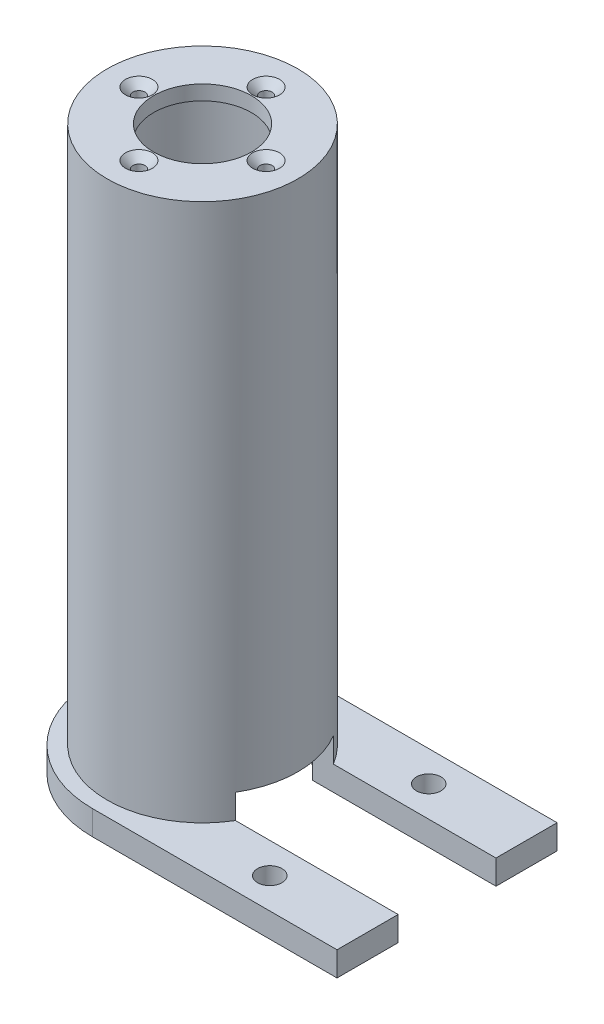
ISO-10303-21;
HEADER;
FILE_DESCRIPTION(('STEP AP214'),'2;1');
FILE_NAME('part.step','',(''),(''),'','','');
FILE_SCHEMA(('AUTOMOTIVE_DESIGN { 1 0 10303 214 1 1 1 1 }'));
ENDSEC;
DATA;
#1=APPLICATION_CONTEXT('core data for automotive mechanical design processes');
#2=APPLICATION_PROTOCOL_DEFINITION('international standard','automotive_design',2000,#1);
#3=PRODUCT_CONTEXT('',#1,'mechanical');
#4=PRODUCT('Part','Part','',(#3));
#5=PRODUCT_RELATED_PRODUCT_CATEGORY('part','',(#4));
#6=PRODUCT_DEFINITION_FORMATION('','',#4);
#7=PRODUCT_DEFINITION_CONTEXT('part definition',#1,'design');
#8=PRODUCT_DEFINITION('design','',#6,#7);
#9=PRODUCT_DEFINITION_SHAPE('','',#8);
#10=(LENGTH_UNIT() NAMED_UNIT(*) SI_UNIT(.MILLI.,.METRE.));
#11=(NAMED_UNIT(*) PLANE_ANGLE_UNIT() SI_UNIT($,.RADIAN.));
#12=(NAMED_UNIT(*) SI_UNIT($,.STERADIAN.) SOLID_ANGLE_UNIT());
#13=UNCERTAINTY_MEASURE_WITH_UNIT(LENGTH_MEASURE(1.E-05),#10,'distance_accuracy_value','');
#14=(GEOMETRIC_REPRESENTATION_CONTEXT(3) GLOBAL_UNCERTAINTY_ASSIGNED_CONTEXT((#13)) GLOBAL_UNIT_ASSIGNED_CONTEXT((#10,
#11,#12)) REPRESENTATION_CONTEXT('',''));
#15=CARTESIAN_POINT('',(0.,0.,0.));
#16=DIRECTION('',(0.,0.,1.));
#17=DIRECTION('',(1.,0.,0.));
#18=AXIS2_PLACEMENT_3D('',#15,#16,#17);
#19=CARTESIAN_POINT('',(0.,-115.,0.));
#20=DIRECTION('',(0.,1.,0.));
#21=DIRECTION('',(0.,0.,1.));
#22=AXIS2_PLACEMENT_3D('',#19,#20,#21);
#23=CYLINDRICAL_SURFACE('',#22,19.5);
#24=CARTESIAN_POINT('',(0.,0.,0.));
#25=DIRECTION('',(0.,1.,0.));
#26=DIRECTION('',(0.,0.,1.));
#27=AXIS2_PLACEMENT_3D('',#24,#25,#26);
#28=CIRCLE('',#27,19.5);
#29=CARTESIAN_POINT('',(0.,0.,19.5));
#30=VERTEX_POINT('',#29);
#31=EDGE_CURVE('E161',#30,#30,#28,.T.);
#32=ORIENTED_EDGE('',*,*,#31,.F.);
#33=EDGE_LOOP('',(#32));
#34=FACE_BOUND('',#33,.T.);
#35=CARTESIAN_POINT('',(0.,-105.,0.));
#36=DIRECTION('',(0.,1.,0.));
#37=DIRECTION('',(0.,0.,1.));
#38=AXIS2_PLACEMENT_3D('',#35,#36,#37);
#39=CIRCLE('',#38,19.5);
#40=CARTESIAN_POINT('',(16.7406690427832,-105.,-10.));
#41=VERTEX_POINT('',#40);
#42=CARTESIAN_POINT('',(16.7406690427832,-105.,10.));
#43=VERTEX_POINT('',#42);
#44=EDGE_CURVE('E217',#41,#43,#39,.F.);
#45=ORIENTED_EDGE('',*,*,#44,.F.);
#46=DIRECTION('',(0.,1.,0.));
#47=VECTOR('',#46,1.);
#48=CARTESIAN_POINT('',(16.7406690427832,-115.,-10.));
#49=LINE('',#48,#47);
#50=CARTESIAN_POINT('',(16.7406690427832,-110.,-10.));
#51=VERTEX_POINT('',#50);
#52=EDGE_CURVE('E230',#41,#51,#49,.F.);
#53=ORIENTED_EDGE('',*,*,#52,.T.);
#54=CARTESIAN_POINT('',(0.,-110.,0.));
#55=DIRECTION('',(0.,1.,0.));
#56=DIRECTION('',(0.,0.,1.));
#57=AXIS2_PLACEMENT_3D('',#54,#55,#56);
#58=CIRCLE('',#57,19.5);
#59=CARTESIAN_POINT('',(16.7406690427832,-110.,10.));
#60=VERTEX_POINT('',#59);
#61=EDGE_CURVE('E164',#60,#51,#58,.F.);
#62=ORIENTED_EDGE('',*,*,#61,.F.);
#63=DIRECTION('',(0.,1.,0.));
#64=VECTOR('',#63,1.);
#65=CARTESIAN_POINT('',(16.7406690427832,-115.,10.));
#66=LINE('',#65,#64);
#67=EDGE_CURVE('E225',#60,#43,#66,.T.);
#68=ORIENTED_EDGE('',*,*,#67,.T.);
#69=EDGE_LOOP('',(#45,#53,#62,#68));
#70=FACE_BOUND('',#69,.T.);
#71=ADVANCED_FACE('F36',(#34,#70),#23,.T.);
#72=CARTESIAN_POINT('',(50.,-110.,0.));
#73=DIRECTION('',(-1.,0.,0.));
#74=DIRECTION('',(0.,0.,1.));
#75=AXIS2_PLACEMENT_3D('',#72,#73,#74);
#76=PLANE('',#75);
#77=DIRECTION('',(0.,-1.,0.));
#78=VECTOR('',#77,1.);
#79=CARTESIAN_POINT('',(50.,-46.1483519286549,-10.));
#80=LINE('',#79,#78);
#81=CARTESIAN_POINT('',(50.,-110.,-10.));
#82=VERTEX_POINT('',#81);
#83=CARTESIAN_POINT('',(50.,-115.,-10.));
#84=VERTEX_POINT('',#83);
#85=EDGE_CURVE('E128',#82,#84,#80,.T.);
#86=ORIENTED_EDGE('',*,*,#85,.T.);
#87=DIRECTION('',(0.,0.,-1.));
#88=VECTOR('',#87,1.);
#89=CARTESIAN_POINT('',(50.,-115.,0.));
#90=LINE('',#89,#88);
#91=CARTESIAN_POINT('',(50.,-115.,-22.5));
#92=VERTEX_POINT('',#91);
#93=EDGE_CURVE('E85',#84,#92,#90,.T.);
#94=ORIENTED_EDGE('',*,*,#93,.T.);
#95=DIRECTION('',(0.,-1.,0.));
#96=VECTOR('',#95,1.);
#97=CARTESIAN_POINT('',(50.,-110.,-22.5));
#98=LINE('',#97,#96);
#99=CARTESIAN_POINT('',(50.,-110.,-22.5));
#100=VERTEX_POINT('',#99);
#101=EDGE_CURVE('E150',#100,#92,#98,.T.);
#102=ORIENTED_EDGE('',*,*,#101,.F.);
#103=DIRECTION('',(0.,0.,-1.));
#104=VECTOR('',#103,1.);
#105=CARTESIAN_POINT('',(50.,-110.,0.));
#106=LINE('',#105,#104);
#107=EDGE_CURVE('E63',#82,#100,#106,.T.);
#108=ORIENTED_EDGE('',*,*,#107,.F.);
#109=EDGE_LOOP('',(#86,#94,#102,#108));
#110=FACE_BOUND('',#109,.T.);
#111=ADVANCED_FACE('F135',(#110),#76,.F.);
#112=DIRECTION('',(0.,-1.,0.));
#113=VECTOR('',#112,1.);
#114=CARTESIAN_POINT('',(50.,-46.1483519286549,10.));
#115=LINE('',#114,#113);
#116=CARTESIAN_POINT('',(50.,-110.,10.));
#117=VERTEX_POINT('',#116);
#118=CARTESIAN_POINT('',(50.,-115.,10.));
#119=VERTEX_POINT('',#118);
#120=EDGE_CURVE('E214',#117,#119,#115,.T.);
#121=ORIENTED_EDGE('',*,*,#120,.F.);
#122=CARTESIAN_POINT('',(50.,-110.,22.5));
#123=VERTEX_POINT('',#122);
#124=EDGE_CURVE('E153',#123,#117,#106,.T.);
#125=ORIENTED_EDGE('',*,*,#124,.F.);
#126=DIRECTION('',(0.,-1.,0.));
#127=VECTOR('',#126,1.);
#128=CARTESIAN_POINT('',(50.,-110.,22.5));
#129=LINE('',#128,#127);
#130=CARTESIAN_POINT('',(50.,-115.,22.5));
#131=VERTEX_POINT('',#130);
#132=EDGE_CURVE('E152',#123,#131,#129,.T.);
#133=ORIENTED_EDGE('',*,*,#132,.T.);
#134=EDGE_CURVE('E141',#131,#119,#90,.T.);
#135=ORIENTED_EDGE('',*,*,#134,.T.);
#136=EDGE_LOOP('',(#121,#125,#133,#135));
#137=FACE_BOUND('',#136,.T.);
#138=ADVANCED_FACE('F267',(#137),#76,.F.);
#139=CARTESIAN_POINT('',(0.,-110.,0.));
#140=DIRECTION('',(0.,1.,0.));
#141=DIRECTION('',(0.,0.,1.));
#142=AXIS2_PLACEMENT_3D('',#139,#140,#141);
#143=PLANE('',#142);
#144=CARTESIAN_POINT('',(30.,-110.,-16.25));
#145=DIRECTION('',(0.,1.,0.));
#146=DIRECTION('',(0.,0.,1.));
#147=AXIS2_PLACEMENT_3D('',#144,#145,#146);
#148=CIRCLE('',#147,2.50000000000001);
#149=CARTESIAN_POINT('',(30.,-110.,-13.75));
#150=VERTEX_POINT('',#149);
#151=EDGE_CURVE('E201',#150,#150,#148,.T.);
#152=ORIENTED_EDGE('',*,*,#151,.F.);
#153=EDGE_LOOP('',(#152));
#154=FACE_BOUND('',#153,.T.);
#155=CARTESIAN_POINT('',(30.,-110.,16.25));
#156=DIRECTION('',(0.,1.,0.));
#157=DIRECTION('',(0.,0.,1.));
#158=AXIS2_PLACEMENT_3D('',#155,#156,#157);
#159=CIRCLE('',#158,2.50000000000001);
#160=CARTESIAN_POINT('',(30.,-110.,18.75));
#161=VERTEX_POINT('',#160);
#162=EDGE_CURVE('E206',#161,#161,#159,.T.);
#163=ORIENTED_EDGE('',*,*,#162,.F.);
#164=EDGE_LOOP('',(#163));
#165=FACE_BOUND('',#164,.T.);
#166=ORIENTED_EDGE('',*,*,#61,.T.);
#167=DIRECTION('',(1.,0.,0.));
#168=VECTOR('',#167,1.);
#169=CARTESIAN_POINT('',(0.,-110.,-10.));
#170=LINE('',#169,#168);
#171=EDGE_CURVE('E228',#51,#82,#170,.T.);
#172=ORIENTED_EDGE('',*,*,#171,.T.);
#173=ORIENTED_EDGE('',*,*,#107,.T.);
#174=DIRECTION('',(-1.,0.,0.));
#175=VECTOR('',#174,1.);
#176=CARTESIAN_POINT('',(0.,-110.,-22.5));
#177=LINE('',#176,#175);
#178=CARTESIAN_POINT('',(0.,-110.,-22.5));
#179=VERTEX_POINT('',#178);
#180=EDGE_CURVE('E145',#100,#179,#177,.T.);
#181=ORIENTED_EDGE('',*,*,#180,.T.);
#182=CARTESIAN_POINT('',(0.,-110.,0.));
#183=DIRECTION('',(0.,1.,0.));
#184=DIRECTION('',(0.,0.,1.));
#185=AXIS2_PLACEMENT_3D('',#182,#183,#184);
#186=CIRCLE('',#185,22.5);
#187=CARTESIAN_POINT('',(0.,-110.,22.5));
#188=VERTEX_POINT('',#187);
#189=EDGE_CURVE('E93',#179,#188,#186,.T.);
#190=ORIENTED_EDGE('',*,*,#189,.T.);
#191=DIRECTION('',(1.,0.,0.));
#192=VECTOR('',#191,1.);
#193=CARTESIAN_POINT('',(0.,-110.,22.5));
#194=LINE('',#193,#192);
#195=EDGE_CURVE('E253',#188,#123,#194,.T.);
#196=ORIENTED_EDGE('',*,*,#195,.T.);
#197=ORIENTED_EDGE('',*,*,#124,.T.);
#198=DIRECTION('',(-1.,0.,0.));
#199=VECTOR('',#198,1.);
#200=CARTESIAN_POINT('',(0.,-110.,10.));
#201=LINE('',#200,#199);
#202=EDGE_CURVE('E222',#117,#60,#201,.T.);
#203=ORIENTED_EDGE('',*,*,#202,.T.);
#204=EDGE_LOOP('',(#166,#172,#173,#181,#190,#196,#197,#203));
#205=FACE_BOUND('',#204,.T.);
#206=ADVANCED_FACE('F269',(#154,#165,#205),#143,.T.);
#207=CARTESIAN_POINT('',(0.,-115.,0.));
#208=DIRECTION('',(0.,1.,0.));
#209=DIRECTION('',(0.,0.,1.));
#210=AXIS2_PLACEMENT_3D('',#207,#208,#209);
#211=PLANE('',#210);
#212=CARTESIAN_POINT('',(30.,-115.,-16.25));
#213=DIRECTION('',(0.,1.,0.));
#214=DIRECTION('',(0.,0.,1.));
#215=AXIS2_PLACEMENT_3D('',#212,#213,#214);
#216=CIRCLE('',#215,2.50000000000001);
#217=CARTESIAN_POINT('',(30.,-115.,-13.75));
#218=VERTEX_POINT('',#217);
#219=EDGE_CURVE('E41',#218,#218,#216,.T.);
#220=ORIENTED_EDGE('',*,*,#219,.T.);
#221=EDGE_LOOP('',(#220));
#222=FACE_BOUND('',#221,.T.);
#223=CARTESIAN_POINT('',(30.,-115.,16.25));
#224=DIRECTION('',(0.,1.,0.));
#225=DIRECTION('',(0.,0.,1.));
#226=AXIS2_PLACEMENT_3D('',#223,#224,#225);
#227=CIRCLE('',#226,2.50000000000001);
#228=CARTESIAN_POINT('',(30.,-115.,18.75));
#229=VERTEX_POINT('',#228);
#230=EDGE_CURVE('E199',#229,#229,#227,.T.);
#231=ORIENTED_EDGE('',*,*,#230,.T.);
#232=EDGE_LOOP('',(#231));
#233=FACE_BOUND('',#232,.T.);
#234=DIRECTION('',(-1.,0.,0.));
#235=VECTOR('',#234,1.);
#236=CARTESIAN_POINT('',(0.,-115.,-10.));
#237=LINE('',#236,#235);
#238=CARTESIAN_POINT('',(12.4899959967968,-115.,-10.));
#239=VERTEX_POINT('',#238);
#240=EDGE_CURVE('E125',#84,#239,#237,.T.);
#241=ORIENTED_EDGE('',*,*,#240,.T.);
#242=CARTESIAN_POINT('',(0.,-115.,0.));
#243=DIRECTION('',(0.,1.,0.));
#244=DIRECTION('',(0.,0.,1.));
#245=AXIS2_PLACEMENT_3D('',#242,#243,#244);
#246=CIRCLE('',#245,16.);
#247=CARTESIAN_POINT('',(12.4899959967968,-115.,10.));
#248=VERTEX_POINT('',#247);
#249=EDGE_CURVE('E247',#239,#248,#246,.T.);
#250=ORIENTED_EDGE('',*,*,#249,.T.);
#251=DIRECTION('',(1.,0.,0.));
#252=VECTOR('',#251,1.);
#253=CARTESIAN_POINT('',(0.,-115.,10.));
#254=LINE('',#253,#252);
#255=EDGE_CURVE('E133',#248,#119,#254,.T.);
#256=ORIENTED_EDGE('',*,*,#255,.T.);
#257=ORIENTED_EDGE('',*,*,#134,.F.);
#258=DIRECTION('',(1.,0.,0.));
#259=VECTOR('',#258,1.);
#260=CARTESIAN_POINT('',(0.,-115.,22.5));
#261=LINE('',#260,#259);
#262=CARTESIAN_POINT('',(0.,-115.,22.5));
#263=VERTEX_POINT('',#262);
#264=EDGE_CURVE('E142',#263,#131,#261,.T.);
#265=ORIENTED_EDGE('',*,*,#264,.F.);
#266=CARTESIAN_POINT('',(0.,-115.,0.));
#267=DIRECTION('',(0.,1.,0.));
#268=DIRECTION('',(0.,0.,1.));
#269=AXIS2_PLACEMENT_3D('',#266,#267,#268);
#270=CIRCLE('',#269,22.5);
#271=CARTESIAN_POINT('',(0.,-115.,-22.5));
#272=VERTEX_POINT('',#271);
#273=EDGE_CURVE('E146',#272,#263,#270,.T.);
#274=ORIENTED_EDGE('',*,*,#273,.F.);
#275=DIRECTION('',(-1.,0.,0.));
#276=VECTOR('',#275,1.);
#277=CARTESIAN_POINT('',(0.,-115.,-22.5));
#278=LINE('',#277,#276);
#279=EDGE_CURVE('E140',#92,#272,#278,.T.);
#280=ORIENTED_EDGE('',*,*,#279,.F.);
#281=ORIENTED_EDGE('',*,*,#93,.F.);
#282=EDGE_LOOP('',(#241,#250,#256,#257,#265,#274,#280,#281));
#283=FACE_BOUND('',#282,.T.);
#284=ADVANCED_FACE('F138',(#222,#233,#283),#211,.F.);
#285=CARTESIAN_POINT('',(0.,-115.,0.));
#286=DIRECTION('',(0.,1.,0.));
#287=DIRECTION('',(0.,0.,1.));
#288=AXIS2_PLACEMENT_3D('',#285,#286,#287);
#289=CYLINDRICAL_SURFACE('',#288,16.);
#290=CARTESIAN_POINT('',(0.,-3.,0.));
#291=DIRECTION('',(0.,1.,0.));
#292=DIRECTION('',(0.,0.,1.));
#293=AXIS2_PLACEMENT_3D('',#290,#291,#292);
#294=CIRCLE('',#293,16.);
#295=CARTESIAN_POINT('',(0.,-3.,16.));
#296=VERTEX_POINT('',#295);
#297=EDGE_CURVE('E171',#296,#296,#294,.T.);
#298=ORIENTED_EDGE('',*,*,#297,.T.);
#299=EDGE_LOOP('',(#298));
#300=FACE_BOUND('',#299,.T.);
#301=DIRECTION('',(0.,1.,0.));
#302=VECTOR('',#301,1.);
#303=CARTESIAN_POINT('',(12.4899959967968,-115.,-10.));
#304=LINE('',#303,#302);
#305=CARTESIAN_POINT('',(12.4899959967968,-105.,-10.));
#306=VERTEX_POINT('',#305);
#307=EDGE_CURVE('E12',#306,#239,#304,.F.);
#308=ORIENTED_EDGE('',*,*,#307,.F.);
#309=CARTESIAN_POINT('',(0.,-105.,0.));
#310=DIRECTION('',(0.,1.,0.));
#311=DIRECTION('',(0.,0.,1.));
#312=AXIS2_PLACEMENT_3D('',#309,#310,#311);
#313=CIRCLE('',#312,16.);
#314=CARTESIAN_POINT('',(12.4899959967968,-105.,10.));
#315=VERTEX_POINT('',#314);
#316=EDGE_CURVE('E196',#306,#315,#313,.F.);
#317=ORIENTED_EDGE('',*,*,#316,.T.);
#318=DIRECTION('',(0.,1.,0.));
#319=VECTOR('',#318,1.);
#320=CARTESIAN_POINT('',(12.4899959967968,-115.,10.));
#321=LINE('',#320,#319);
#322=EDGE_CURVE('E46',#248,#315,#321,.T.);
#323=ORIENTED_EDGE('',*,*,#322,.F.);
#324=ORIENTED_EDGE('',*,*,#249,.F.);
#325=EDGE_LOOP('',(#308,#317,#323,#324));
#326=FACE_BOUND('',#325,.T.);
#327=ADVANCED_FACE('F282',(#300,#326),#289,.F.);
#328=CARTESIAN_POINT('',(0.,0.,0.));
#329=DIRECTION('',(0.,1.,0.));
#330=DIRECTION('',(0.,0.,1.));
#331=AXIS2_PLACEMENT_3D('',#328,#329,#330);
#332=PLANE('',#331);
#333=CARTESIAN_POINT('',(0.,0.,13.));
#334=DIRECTION('',(0.,1.,0.));
#335=DIRECTION('',(0.,0.,1.));
#336=AXIS2_PLACEMENT_3D('',#333,#334,#335);
#337=CIRCLE('',#336,2.75);
#338=CARTESIAN_POINT('',(0.,0.,15.75));
#339=VERTEX_POINT('',#338);
#340=EDGE_CURVE('E184',#339,#339,#337,.F.);
#341=ORIENTED_EDGE('',*,*,#340,.T.);
#342=EDGE_LOOP('',(#341));
#343=FACE_BOUND('',#342,.T.);
#344=CARTESIAN_POINT('',(13.,0.,0.));
#345=DIRECTION('',(0.,1.,0.));
#346=DIRECTION('',(0.,0.,1.));
#347=AXIS2_PLACEMENT_3D('',#344,#345,#346);
#348=CIRCLE('',#347,2.75);
#349=CARTESIAN_POINT('',(13.,0.,2.75));
#350=VERTEX_POINT('',#349);
#351=EDGE_CURVE('E181',#350,#350,#348,.F.);
#352=ORIENTED_EDGE('',*,*,#351,.T.);
#353=EDGE_LOOP('',(#352));
#354=FACE_BOUND('',#353,.T.);
#355=CARTESIAN_POINT('',(0.,0.,-13.));
#356=DIRECTION('',(0.,1.,0.));
#357=DIRECTION('',(0.,0.,1.));
#358=AXIS2_PLACEMENT_3D('',#355,#356,#357);
#359=CIRCLE('',#358,2.75);
#360=CARTESIAN_POINT('',(0.,0.,-10.25));
#361=VERTEX_POINT('',#360);
#362=EDGE_CURVE('E178',#361,#361,#359,.F.);
#363=ORIENTED_EDGE('',*,*,#362,.T.);
#364=EDGE_LOOP('',(#363));
#365=FACE_BOUND('',#364,.T.);
#366=CARTESIAN_POINT('',(-13.,0.,0.));
#367=DIRECTION('',(0.,1.,0.));
#368=DIRECTION('',(0.,0.,1.));
#369=AXIS2_PLACEMENT_3D('',#366,#367,#368);
#370=CIRCLE('',#369,2.75);
#371=CARTESIAN_POINT('',(-13.,0.,2.75));
#372=VERTEX_POINT('',#371);
#373=EDGE_CURVE('E175',#372,#372,#370,.F.);
#374=ORIENTED_EDGE('',*,*,#373,.T.);
#375=EDGE_LOOP('',(#374));
#376=FACE_BOUND('',#375,.T.);
#377=CARTESIAN_POINT('',(0.,0.,0.));
#378=DIRECTION('',(0.,1.,0.));
#379=DIRECTION('',(0.,0.,1.));
#380=AXIS2_PLACEMENT_3D('',#377,#378,#379);
#381=CIRCLE('',#380,10.);
#382=CARTESIAN_POINT('',(0.,0.,10.));
#383=VERTEX_POINT('',#382);
#384=EDGE_CURVE('E172',#383,#383,#381,.T.);
#385=ORIENTED_EDGE('',*,*,#384,.F.);
#386=EDGE_LOOP('',(#385));
#387=FACE_BOUND('',#386,.T.);
#388=ORIENTED_EDGE('',*,*,#31,.T.);
#389=EDGE_LOOP('',(#388));
#390=FACE_BOUND('',#389,.T.);
#391=ADVANCED_FACE('F275',(#343,#354,#365,#376,#387,#390),#332,.T.);
#392=CARTESIAN_POINT('',(0.,-110.,-22.5));
#393=DIRECTION('',(0.,0.,1.));
#394=DIRECTION('',(1.,0.,0.));
#395=AXIS2_PLACEMENT_3D('',#392,#393,#394);
#396=PLANE('',#395);
#397=ORIENTED_EDGE('',*,*,#279,.T.);
#398=DIRECTION('',(0.,-1.,0.));
#399=VECTOR('',#398,1.);
#400=CARTESIAN_POINT('',(0.,-110.,-22.5));
#401=LINE('',#400,#399);
#402=EDGE_CURVE('E159',#179,#272,#401,.T.);
#403=ORIENTED_EDGE('',*,*,#402,.F.);
#404=ORIENTED_EDGE('',*,*,#180,.F.);
#405=ORIENTED_EDGE('',*,*,#101,.T.);
#406=EDGE_LOOP('',(#397,#403,#404,#405));
#407=FACE_BOUND('',#406,.T.);
#408=ADVANCED_FACE('F273',(#407),#396,.F.);
#409=CARTESIAN_POINT('',(0.,-110.,0.));
#410=DIRECTION('',(0.,-1.,0.));
#411=DIRECTION('',(0.,0.,-1.));
#412=AXIS2_PLACEMENT_3D('',#409,#410,#411);
#413=CYLINDRICAL_SURFACE('',#412,22.5);
#414=ORIENTED_EDGE('',*,*,#273,.T.);
#415=DIRECTION('',(0.,-1.,0.));
#416=VECTOR('',#415,1.);
#417=CARTESIAN_POINT('',(0.,-110.,22.5));
#418=LINE('',#417,#416);
#419=EDGE_CURVE('E156',#188,#263,#418,.T.);
#420=ORIENTED_EDGE('',*,*,#419,.F.);
#421=ORIENTED_EDGE('',*,*,#189,.F.);
#422=ORIENTED_EDGE('',*,*,#402,.T.);
#423=EDGE_LOOP('',(#414,#420,#421,#422));
#424=FACE_BOUND('',#423,.T.);
#425=ADVANCED_FACE('F257',(#424),#413,.T.);
#426=CARTESIAN_POINT('',(0.,-110.,22.5));
#427=DIRECTION('',(0.,0.,-1.));
#428=DIRECTION('',(-1.,0.,0.));
#429=AXIS2_PLACEMENT_3D('',#426,#427,#428);
#430=PLANE('',#429);
#431=ORIENTED_EDGE('',*,*,#264,.T.);
#432=ORIENTED_EDGE('',*,*,#132,.F.);
#433=ORIENTED_EDGE('',*,*,#195,.F.);
#434=ORIENTED_EDGE('',*,*,#419,.T.);
#435=EDGE_LOOP('',(#431,#432,#433,#434));
#436=FACE_BOUND('',#435,.T.);
#437=ADVANCED_FACE('F262',(#436),#430,.F.);
#438=CARTESIAN_POINT('',(0.,-3.,0.));
#439=DIRECTION('',(0.,1.,0.));
#440=DIRECTION('',(0.,0.,1.));
#441=AXIS2_PLACEMENT_3D('',#438,#439,#440);
#442=PLANE('',#441);
#443=CARTESIAN_POINT('',(0.,-3.,-13.));
#444=DIRECTION('',(0.,1.,0.));
#445=DIRECTION('',(0.,0.,1.));
#446=AXIS2_PLACEMENT_3D('',#443,#444,#445);
#447=CIRCLE('',#446,1.25);
#448=CARTESIAN_POINT('',(0.,-3.,-11.75));
#449=VERTEX_POINT('',#448);
#450=EDGE_CURVE('E234',#449,#449,#447,.F.);
#451=ORIENTED_EDGE('',*,*,#450,.F.);
#452=EDGE_LOOP('',(#451));
#453=FACE_BOUND('',#452,.T.);
#454=CARTESIAN_POINT('',(13.,-3.,0.));
#455=DIRECTION('',(0.,1.,0.));
#456=DIRECTION('',(0.,0.,1.));
#457=AXIS2_PLACEMENT_3D('',#454,#455,#456);
#458=CIRCLE('',#457,1.25);
#459=CARTESIAN_POINT('',(13.,-3.,1.25));
#460=VERTEX_POINT('',#459);
#461=EDGE_CURVE('E237',#460,#460,#458,.F.);
#462=ORIENTED_EDGE('',*,*,#461,.F.);
#463=EDGE_LOOP('',(#462));
#464=FACE_BOUND('',#463,.T.);
#465=CARTESIAN_POINT('',(0.,-3.,13.));
#466=DIRECTION('',(0.,1.,0.));
#467=DIRECTION('',(0.,0.,1.));
#468=AXIS2_PLACEMENT_3D('',#465,#466,#467);
#469=CIRCLE('',#468,1.25);
#470=CARTESIAN_POINT('',(0.,-3.,14.25));
#471=VERTEX_POINT('',#470);
#472=EDGE_CURVE('E240',#471,#471,#469,.F.);
#473=ORIENTED_EDGE('',*,*,#472,.F.);
#474=EDGE_LOOP('',(#473));
#475=FACE_BOUND('',#474,.T.);
#476=CARTESIAN_POINT('',(-13.,-3.,0.));
#477=DIRECTION('',(0.,1.,0.));
#478=DIRECTION('',(0.,0.,1.));
#479=AXIS2_PLACEMENT_3D('',#476,#477,#478);
#480=CIRCLE('',#479,1.25);
#481=CARTESIAN_POINT('',(-13.,-3.,1.25));
#482=VERTEX_POINT('',#481);
#483=EDGE_CURVE('E233',#482,#482,#480,.F.);
#484=ORIENTED_EDGE('',*,*,#483,.F.);
#485=EDGE_LOOP('',(#484));
#486=FACE_BOUND('',#485,.T.);
#487=CARTESIAN_POINT('',(0.,-3.,0.));
#488=DIRECTION('',(0.,1.,0.));
#489=DIRECTION('',(0.,0.,1.));
#490=AXIS2_PLACEMENT_3D('',#487,#488,#489);
#491=CIRCLE('',#490,10.);
#492=CARTESIAN_POINT('',(0.,-3.,10.));
#493=VERTEX_POINT('',#492);
#494=EDGE_CURVE('E168',#493,#493,#491,.T.);
#495=ORIENTED_EDGE('',*,*,#494,.T.);
#496=EDGE_LOOP('',(#495));
#497=FACE_BOUND('',#496,.T.);
#498=ORIENTED_EDGE('',*,*,#297,.F.);
#499=EDGE_LOOP('',(#498));
#500=FACE_BOUND('',#499,.T.);
#501=ADVANCED_FACE('F330',(#453,#464,#475,#486,#497,#500),#442,.F.);
#502=CARTESIAN_POINT('',(0.,-115.,0.));
#503=DIRECTION('',(0.,1.,0.));
#504=DIRECTION('',(0.,0.,1.));
#505=AXIS2_PLACEMENT_3D('',#502,#503,#504);
#506=CYLINDRICAL_SURFACE('',#505,10.);
#507=ORIENTED_EDGE('',*,*,#384,.T.);
#508=EDGE_LOOP('',(#507));
#509=FACE_BOUND('',#508,.T.);
#510=ORIENTED_EDGE('',*,*,#494,.F.);
#511=EDGE_LOOP('',(#510));
#512=FACE_BOUND('',#511,.T.);
#513=ADVANCED_FACE('F333',(#509,#512),#506,.F.);
#514=CARTESIAN_POINT('',(-13.,-115.001,0.));
#515=DIRECTION('',(0.,1.,0.));
#516=DIRECTION('',(0.,0.,1.));
#517=AXIS2_PLACEMENT_3D('',#514,#515,#516);
#518=CYLINDRICAL_SURFACE('',#517,1.25);
#519=CARTESIAN_POINT('',(-13.,-1.49999999999999,0.));
#520=DIRECTION('',(0.,1.,0.));
#521=DIRECTION('',(0.,0.,1.));
#522=AXIS2_PLACEMENT_3D('',#519,#520,#521);
#523=CIRCLE('',#522,1.25);
#524=CARTESIAN_POINT('',(-13.,-1.49999999999999,1.25));
#525=VERTEX_POINT('',#524);
#526=EDGE_CURVE('E193',#525,#525,#523,.T.);
#527=ORIENTED_EDGE('',*,*,#526,.T.);
#528=EDGE_LOOP('',(#527));
#529=FACE_BOUND('',#528,.T.);
#530=ORIENTED_EDGE('',*,*,#483,.T.);
#531=EDGE_LOOP('',(#530));
#532=FACE_BOUND('',#531,.T.);
#533=ADVANCED_FACE('F373',(#529,#532),#518,.F.);
#534=CARTESIAN_POINT('',(0.,-115.001,13.));
#535=DIRECTION('',(0.,1.,0.));
#536=DIRECTION('',(0.,0.,1.));
#537=AXIS2_PLACEMENT_3D('',#534,#535,#536);
#538=CYLINDRICAL_SURFACE('',#537,1.25);
#539=CARTESIAN_POINT('',(0.,-1.49999999999999,13.));
#540=DIRECTION('',(0.,1.,0.));
#541=DIRECTION('',(0.,0.,1.));
#542=AXIS2_PLACEMENT_3D('',#539,#540,#541);
#543=CIRCLE('',#542,1.25);
#544=CARTESIAN_POINT('',(0.,-1.49999999999999,14.25));
#545=VERTEX_POINT('',#544);
#546=EDGE_CURVE('E167',#545,#545,#543,.T.);
#547=ORIENTED_EDGE('',*,*,#546,.T.);
#548=EDGE_LOOP('',(#547));
#549=FACE_BOUND('',#548,.T.);
#550=ORIENTED_EDGE('',*,*,#472,.T.);
#551=EDGE_LOOP('',(#550));
#552=FACE_BOUND('',#551,.T.);
#553=ADVANCED_FACE('F369',(#549,#552),#538,.F.);
#554=CARTESIAN_POINT('',(13.,-115.001,0.));
#555=DIRECTION('',(0.,1.,0.));
#556=DIRECTION('',(0.,0.,1.));
#557=AXIS2_PLACEMENT_3D('',#554,#555,#556);
#558=CYLINDRICAL_SURFACE('',#557,1.25);
#559=CARTESIAN_POINT('',(13.,-1.49999999999999,0.));
#560=DIRECTION('',(0.,1.,0.));
#561=DIRECTION('',(0.,0.,1.));
#562=AXIS2_PLACEMENT_3D('',#559,#560,#561);
#563=CIRCLE('',#562,1.25);
#564=CARTESIAN_POINT('',(13.,-1.49999999999999,1.25));
#565=VERTEX_POINT('',#564);
#566=EDGE_CURVE('E187',#565,#565,#563,.T.);
#567=ORIENTED_EDGE('',*,*,#566,.T.);
#568=EDGE_LOOP('',(#567));
#569=FACE_BOUND('',#568,.T.);
#570=ORIENTED_EDGE('',*,*,#461,.T.);
#571=EDGE_LOOP('',(#570));
#572=FACE_BOUND('',#571,.T.);
#573=ADVANCED_FACE('F326',(#569,#572),#558,.F.);
#574=CARTESIAN_POINT('',(0.,-115.001,-13.));
#575=DIRECTION('',(0.,1.,0.));
#576=DIRECTION('',(0.,0.,1.));
#577=AXIS2_PLACEMENT_3D('',#574,#575,#576);
#578=CYLINDRICAL_SURFACE('',#577,1.25);
#579=CARTESIAN_POINT('',(0.,-1.49999999999999,-13.));
#580=DIRECTION('',(0.,1.,0.));
#581=DIRECTION('',(0.,0.,1.));
#582=AXIS2_PLACEMENT_3D('',#579,#580,#581);
#583=CIRCLE('',#582,1.25);
#584=CARTESIAN_POINT('',(0.,-1.49999999999999,-11.75));
#585=VERTEX_POINT('',#584);
#586=EDGE_CURVE('E190',#585,#585,#583,.T.);
#587=ORIENTED_EDGE('',*,*,#586,.T.);
#588=EDGE_LOOP('',(#587));
#589=FACE_BOUND('',#588,.T.);
#590=ORIENTED_EDGE('',*,*,#450,.T.);
#591=EDGE_LOOP('',(#590));
#592=FACE_BOUND('',#591,.T.);
#593=ADVANCED_FACE('F304',(#589,#592),#578,.F.);
#594=CARTESIAN_POINT('',(0.,-1.49999999999999,13.));
#595=DIRECTION('',(0.,1.,0.));
#596=DIRECTION('',(0.,0.,1.));
#597=AXIS2_PLACEMENT_3D('',#594,#595,#596);
#598=CONICAL_SURFACE('',#597,1.25,0.785398163397454);
#599=ORIENTED_EDGE('',*,*,#340,.F.);
#600=EDGE_LOOP('',(#599));
#601=FACE_BOUND('',#600,.T.);
#602=ORIENTED_EDGE('',*,*,#546,.F.);
#603=EDGE_LOOP('',(#602));
#604=FACE_BOUND('',#603,.T.);
#605=ADVANCED_FACE('F297',(#601,#604),#598,.F.);
#606=CARTESIAN_POINT('',(13.,-1.49999999999999,0.));
#607=DIRECTION('',(0.,1.,0.));
#608=DIRECTION('',(0.,0.,1.));
#609=AXIS2_PLACEMENT_3D('',#606,#607,#608);
#610=CONICAL_SURFACE('',#609,1.25,0.785398163397454);
#611=ORIENTED_EDGE('',*,*,#351,.F.);
#612=EDGE_LOOP('',(#611));
#613=FACE_BOUND('',#612,.T.);
#614=ORIENTED_EDGE('',*,*,#566,.F.);
#615=EDGE_LOOP('',(#614));
#616=FACE_BOUND('',#615,.T.);
#617=ADVANCED_FACE('F303',(#613,#616),#610,.F.);
#618=CARTESIAN_POINT('',(0.,-1.49999999999999,-13.));
#619=DIRECTION('',(0.,1.,0.));
#620=DIRECTION('',(0.,0.,1.));
#621=AXIS2_PLACEMENT_3D('',#618,#619,#620);
#622=CONICAL_SURFACE('',#621,1.25,0.785398163397454);
#623=ORIENTED_EDGE('',*,*,#362,.F.);
#624=EDGE_LOOP('',(#623));
#625=FACE_BOUND('',#624,.T.);
#626=ORIENTED_EDGE('',*,*,#586,.F.);
#627=EDGE_LOOP('',(#626));
#628=FACE_BOUND('',#627,.T.);
#629=ADVANCED_FACE('F310',(#625,#628),#622,.F.);
#630=CARTESIAN_POINT('',(-13.,-1.49999999999999,0.));
#631=DIRECTION('',(0.,1.,0.));
#632=DIRECTION('',(0.,0.,1.));
#633=AXIS2_PLACEMENT_3D('',#630,#631,#632);
#634=CONICAL_SURFACE('',#633,1.25,0.785398163397454);
#635=ORIENTED_EDGE('',*,*,#373,.F.);
#636=EDGE_LOOP('',(#635));
#637=FACE_BOUND('',#636,.T.);
#638=ORIENTED_EDGE('',*,*,#526,.F.);
#639=EDGE_LOOP('',(#638));
#640=FACE_BOUND('',#639,.T.);
#641=ADVANCED_FACE('F39',(#637,#640),#634,.F.);
#642=CARTESIAN_POINT('',(0.,-46.1483519286549,-10.));
#643=DIRECTION('',(0.,0.,1.));
#644=DIRECTION('',(1.,0.,0.));
#645=AXIS2_PLACEMENT_3D('',#642,#643,#644);
#646=PLANE('',#645);
#647=DIRECTION('',(-1.,0.,0.));
#648=VECTOR('',#647,1.);
#649=CARTESIAN_POINT('',(0.,-105.,-10.));
#650=LINE('',#649,#648);
#651=EDGE_CURVE('E218',#41,#306,#650,.T.);
#652=ORIENTED_EDGE('',*,*,#651,.T.);
#653=ORIENTED_EDGE('',*,*,#307,.T.);
#654=ORIENTED_EDGE('',*,*,#240,.F.);
#655=ORIENTED_EDGE('',*,*,#85,.F.);
#656=ORIENTED_EDGE('',*,*,#171,.F.);
#657=ORIENTED_EDGE('',*,*,#52,.F.);
#658=EDGE_LOOP('',(#652,#653,#654,#655,#656,#657));
#659=FACE_BOUND('',#658,.T.);
#660=ADVANCED_FACE('F127',(#659),#646,.T.);
#661=CARTESIAN_POINT('',(0.,-46.1483519286549,10.));
#662=DIRECTION('',(0.,0.,-1.));
#663=DIRECTION('',(-1.,0.,0.));
#664=AXIS2_PLACEMENT_3D('',#661,#662,#663);
#665=PLANE('',#664);
#666=ORIENTED_EDGE('',*,*,#202,.F.);
#667=ORIENTED_EDGE('',*,*,#120,.T.);
#668=ORIENTED_EDGE('',*,*,#255,.F.);
#669=ORIENTED_EDGE('',*,*,#322,.T.);
#670=DIRECTION('',(1.,0.,0.));
#671=VECTOR('',#670,1.);
#672=CARTESIAN_POINT('',(0.,-105.,10.));
#673=LINE('',#672,#671);
#674=EDGE_CURVE('E54',#315,#43,#673,.T.);
#675=ORIENTED_EDGE('',*,*,#674,.T.);
#676=ORIENTED_EDGE('',*,*,#67,.F.);
#677=EDGE_LOOP('',(#666,#667,#668,#669,#675,#676));
#678=FACE_BOUND('',#677,.T.);
#679=ADVANCED_FACE('F350',(#678),#665,.T.);
#680=CARTESIAN_POINT('',(0.,-105.,0.));
#681=DIRECTION('',(0.,1.,0.));
#682=DIRECTION('',(0.,0.,1.));
#683=AXIS2_PLACEMENT_3D('',#680,#681,#682);
#684=PLANE('',#683);
#685=ORIENTED_EDGE('',*,*,#44,.T.);
#686=ORIENTED_EDGE('',*,*,#674,.F.);
#687=ORIENTED_EDGE('',*,*,#316,.F.);
#688=ORIENTED_EDGE('',*,*,#651,.F.);
#689=EDGE_LOOP('',(#685,#686,#687,#688));
#690=FACE_BOUND('',#689,.T.);
#691=ADVANCED_FACE('F353',(#690),#684,.F.);
#692=CARTESIAN_POINT('',(30.,-115.000012,16.25));
#693=DIRECTION('',(0.,1.,0.));
#694=DIRECTION('',(0.,0.,1.));
#695=AXIS2_PLACEMENT_3D('',#692,#693,#694);
#696=CYLINDRICAL_SURFACE('',#695,2.50000000000001);
#697=ORIENTED_EDGE('',*,*,#162,.T.);
#698=EDGE_LOOP('',(#697));
#699=FACE_BOUND('',#698,.T.);
#700=ORIENTED_EDGE('',*,*,#230,.F.);
#701=EDGE_LOOP('',(#700));
#702=FACE_BOUND('',#701,.T.);
#703=ADVANCED_FACE('F355',(#699,#702),#696,.F.);
#704=CARTESIAN_POINT('',(30.,-115.000012,-16.25));
#705=DIRECTION('',(0.,1.,0.));
#706=DIRECTION('',(0.,0.,1.));
#707=AXIS2_PLACEMENT_3D('',#704,#705,#706);
#708=CYLINDRICAL_SURFACE('',#707,2.50000000000001);
#709=ORIENTED_EDGE('',*,*,#151,.T.);
#710=EDGE_LOOP('',(#709));
#711=FACE_BOUND('',#710,.T.);
#712=ORIENTED_EDGE('',*,*,#219,.F.);
#713=EDGE_LOOP('',(#712));
#714=FACE_BOUND('',#713,.T.);
#715=ADVANCED_FACE('F361',(#711,#714),#708,.F.);
#716=CLOSED_SHELL('',(#71,#111,#138,#206,#284,#327,#391,#408,#425,#437,#501,#513,#533,#553,#573,
#593,#605,#617,#629,#641,#660,#679,#691,#703,#715));
#717=MANIFOLD_SOLID_BREP('B2',#716);
#718=ADVANCED_BREP_SHAPE_REPRESENTATION('',(#18,#717),#14);
#719=SHAPE_DEFINITION_REPRESENTATION(#9,#718);
ENDSEC;
END-ISO-10303-21;
